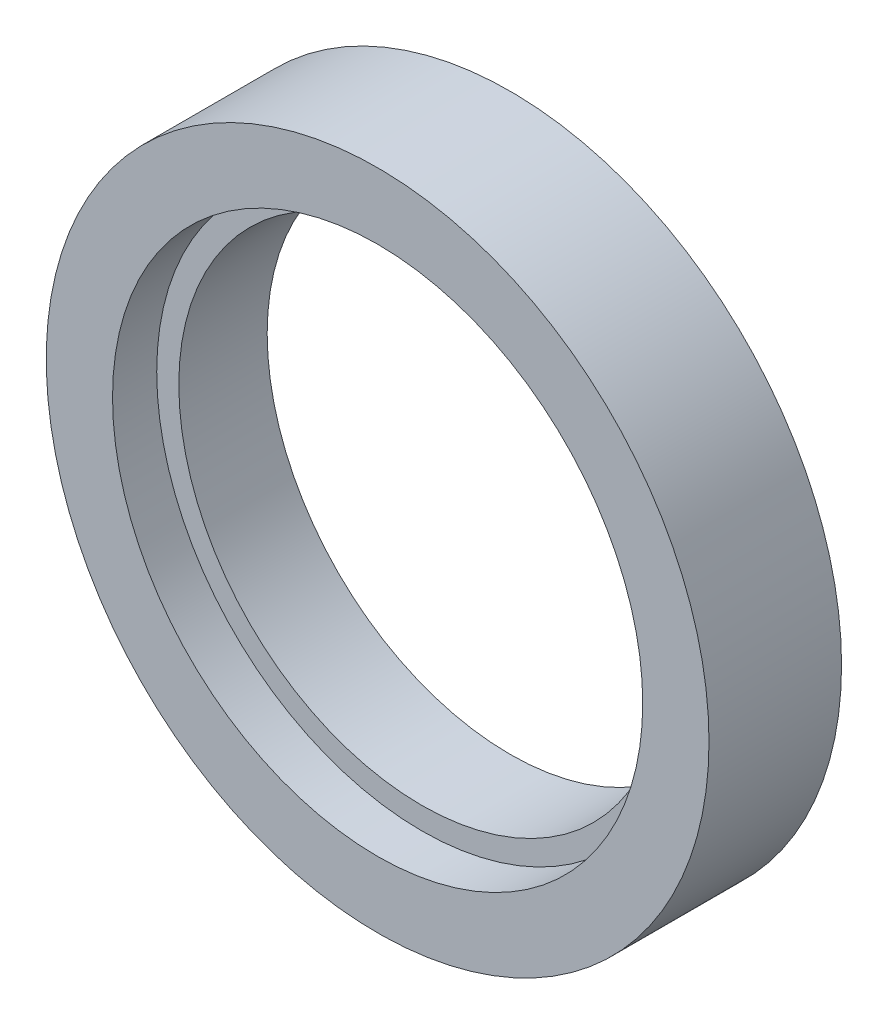
ISO-10303-21;
HEADER;
FILE_DESCRIPTION(('STEP AP214'),'2;1');
FILE_NAME('part.step','',(''),(''),'','','');
FILE_SCHEMA(('AUTOMOTIVE_DESIGN { 1 0 10303 214 1 1 1 1 }'));
ENDSEC;
DATA;
#1=APPLICATION_CONTEXT('core data for automotive mechanical design processes');
#2=APPLICATION_PROTOCOL_DEFINITION('international standard','automotive_design',2000,#1);
#3=PRODUCT_CONTEXT('',#1,'mechanical');
#4=PRODUCT('Part','Part','',(#3));
#5=PRODUCT_RELATED_PRODUCT_CATEGORY('part','',(#4));
#6=PRODUCT_DEFINITION_FORMATION('','',#4);
#7=PRODUCT_DEFINITION_CONTEXT('part definition',#1,'design');
#8=PRODUCT_DEFINITION('design','',#6,#7);
#9=PRODUCT_DEFINITION_SHAPE('','',#8);
#10=(LENGTH_UNIT() NAMED_UNIT(*) SI_UNIT(.MILLI.,.METRE.));
#11=(NAMED_UNIT(*) PLANE_ANGLE_UNIT() SI_UNIT($,.RADIAN.));
#12=(NAMED_UNIT(*) SI_UNIT($,.STERADIAN.) SOLID_ANGLE_UNIT());
#13=UNCERTAINTY_MEASURE_WITH_UNIT(LENGTH_MEASURE(1.E-05),#10,'distance_accuracy_value','');
#14=(GEOMETRIC_REPRESENTATION_CONTEXT(3) GLOBAL_UNCERTAINTY_ASSIGNED_CONTEXT((#13)) GLOBAL_UNIT_ASSIGNED_CONTEXT((#10,
#11,#12)) REPRESENTATION_CONTEXT('',''));
#15=CARTESIAN_POINT('',(0.,0.,0.));
#16=DIRECTION('',(0.,0.,1.));
#17=DIRECTION('',(1.,0.,0.));
#18=AXIS2_PLACEMENT_3D('',#15,#16,#17);
#19=CARTESIAN_POINT('',(0.,0.,3.));
#20=DIRECTION('',(0.,0.,-1.));
#21=DIRECTION('',(-1.,0.,0.));
#22=AXIS2_PLACEMENT_3D('',#19,#20,#21);
#23=CYLINDRICAL_SURFACE('',#22,5.5);
#24=CARTESIAN_POINT('',(0.,0.,0.));
#25=DIRECTION('',(0.,0.,1.));
#26=DIRECTION('',(1.,0.,0.));
#27=AXIS2_PLACEMENT_3D('',#24,#25,#26);
#28=CIRCLE('',#27,5.5);
#29=CARTESIAN_POINT('',(5.5,0.,0.));
#30=VERTEX_POINT('',#29);
#31=EDGE_CURVE('E44',#30,#30,#28,.T.);
#32=ORIENTED_EDGE('',*,*,#31,.F.);
#33=EDGE_LOOP('',(#32));
#34=FACE_BOUND('',#33,.T.);
#35=CARTESIAN_POINT('',(0.,0.,2.));
#36=DIRECTION('',(0.,0.,1.));
#37=DIRECTION('',(1.,0.,0.));
#38=AXIS2_PLACEMENT_3D('',#35,#36,#37);
#39=CIRCLE('',#38,5.5);
#40=CARTESIAN_POINT('',(5.5,0.,2.));
#41=VERTEX_POINT('',#40);
#42=EDGE_CURVE('E35',#41,#41,#39,.T.);
#43=ORIENTED_EDGE('',*,*,#42,.T.);
#44=EDGE_LOOP('',(#43));
#45=FACE_BOUND('',#44,.T.);
#46=ADVANCED_FACE('F31',(#34,#45),#23,.F.);
#47=CARTESIAN_POINT('',(0.,0.,3.));
#48=DIRECTION('',(0.,0.,1.));
#49=DIRECTION('',(1.,0.,0.));
#50=AXIS2_PLACEMENT_3D('',#47,#48,#49);
#51=PLANE('',#50);
#52=CARTESIAN_POINT('',(0.,0.,3.));
#53=DIRECTION('',(0.,0.,1.));
#54=DIRECTION('',(1.,0.,0.));
#55=AXIS2_PLACEMENT_3D('',#52,#53,#54);
#56=CIRCLE('',#55,6.);
#57=CARTESIAN_POINT('',(6.,0.,3.));
#58=VERTEX_POINT('',#57);
#59=EDGE_CURVE('E48',#58,#58,#56,.T.);
#60=ORIENTED_EDGE('',*,*,#59,.F.);
#61=EDGE_LOOP('',(#60));
#62=FACE_BOUND('',#61,.T.);
#63=CARTESIAN_POINT('',(0.,0.,3.));
#64=DIRECTION('',(0.,0.,1.));
#65=DIRECTION('',(1.,0.,0.));
#66=AXIS2_PLACEMENT_3D('',#63,#64,#65);
#67=CIRCLE('',#66,7.5);
#68=CARTESIAN_POINT('',(7.5,0.,3.));
#69=VERTEX_POINT('',#68);
#70=EDGE_CURVE('E10',#69,#69,#67,.T.);
#71=ORIENTED_EDGE('',*,*,#70,.T.);
#72=EDGE_LOOP('',(#71));
#73=FACE_BOUND('',#72,.T.);
#74=ADVANCED_FACE('F69',(#62,#73),#51,.T.);
#75=CARTESIAN_POINT('',(0.,0.,0.));
#76=DIRECTION('',(0.,0.,1.));
#77=DIRECTION('',(1.,0.,0.));
#78=AXIS2_PLACEMENT_3D('',#75,#76,#77);
#79=PLANE('',#78);
#80=CARTESIAN_POINT('',(0.,0.,0.));
#81=DIRECTION('',(0.,0.,1.));
#82=DIRECTION('',(1.,0.,0.));
#83=AXIS2_PLACEMENT_3D('',#80,#81,#82);
#84=CIRCLE('',#83,7.5);
#85=CARTESIAN_POINT('',(7.5,0.,0.));
#86=VERTEX_POINT('',#85);
#87=EDGE_CURVE('E39',#86,#86,#84,.T.);
#88=ORIENTED_EDGE('',*,*,#87,.F.);
#89=EDGE_LOOP('',(#88));
#90=FACE_BOUND('',#89,.T.);
#91=ORIENTED_EDGE('',*,*,#31,.T.);
#92=EDGE_LOOP('',(#91));
#93=FACE_BOUND('',#92,.T.);
#94=ADVANCED_FACE('F75',(#90,#93),#79,.F.);
#95=CARTESIAN_POINT('',(0.,0.,3.));
#96=DIRECTION('',(0.,0.,-1.));
#97=DIRECTION('',(-1.,0.,0.));
#98=AXIS2_PLACEMENT_3D('',#95,#96,#97);
#99=CYLINDRICAL_SURFACE('',#98,7.5);
#100=ORIENTED_EDGE('',*,*,#70,.F.);
#101=EDGE_LOOP('',(#100));
#102=FACE_BOUND('',#101,.T.);
#103=ORIENTED_EDGE('',*,*,#87,.T.);
#104=EDGE_LOOP('',(#103));
#105=FACE_BOUND('',#104,.T.);
#106=ADVANCED_FACE('F33',(#102,#105),#99,.T.);
#107=CARTESIAN_POINT('',(0.,0.,2.));
#108=DIRECTION('',(0.,0.,1.));
#109=DIRECTION('',(1.,0.,0.));
#110=AXIS2_PLACEMENT_3D('',#107,#108,#109);
#111=CYLINDRICAL_SURFACE('',#110,6.);
#112=CARTESIAN_POINT('',(0.,0.,2.));
#113=DIRECTION('',(0.,0.,1.));
#114=DIRECTION('',(1.,0.,0.));
#115=AXIS2_PLACEMENT_3D('',#112,#113,#114);
#116=CIRCLE('',#115,6.);
#117=CARTESIAN_POINT('',(6.,0.,2.));
#118=VERTEX_POINT('',#117);
#119=EDGE_CURVE('E51',#118,#118,#116,.T.);
#120=ORIENTED_EDGE('',*,*,#119,.F.);
#121=EDGE_LOOP('',(#120));
#122=FACE_BOUND('',#121,.T.);
#123=ORIENTED_EDGE('',*,*,#59,.T.);
#124=EDGE_LOOP('',(#123));
#125=FACE_BOUND('',#124,.T.);
#126=ADVANCED_FACE('F61',(#122,#125),#111,.F.);
#127=CARTESIAN_POINT('',(0.,0.,2.));
#128=DIRECTION('',(0.,0.,1.));
#129=DIRECTION('',(1.,0.,0.));
#130=AXIS2_PLACEMENT_3D('',#127,#128,#129);
#131=PLANE('',#130);
#132=ORIENTED_EDGE('',*,*,#42,.F.);
#133=EDGE_LOOP('',(#132));
#134=FACE_BOUND('',#133,.T.);
#135=ORIENTED_EDGE('',*,*,#119,.T.);
#136=EDGE_LOOP('',(#135));
#137=FACE_BOUND('',#136,.T.);
#138=ADVANCED_FACE('F59',(#134,#137),#131,.T.);
#139=CLOSED_SHELL('',(#46,#74,#94,#106,#126,#138));
#140=MANIFOLD_SOLID_BREP('B2',#139);
#141=ADVANCED_BREP_SHAPE_REPRESENTATION('',(#18,#140),#14);
#142=SHAPE_DEFINITION_REPRESENTATION(#9,#141);
ENDSEC;
END-ISO-10303-21;
